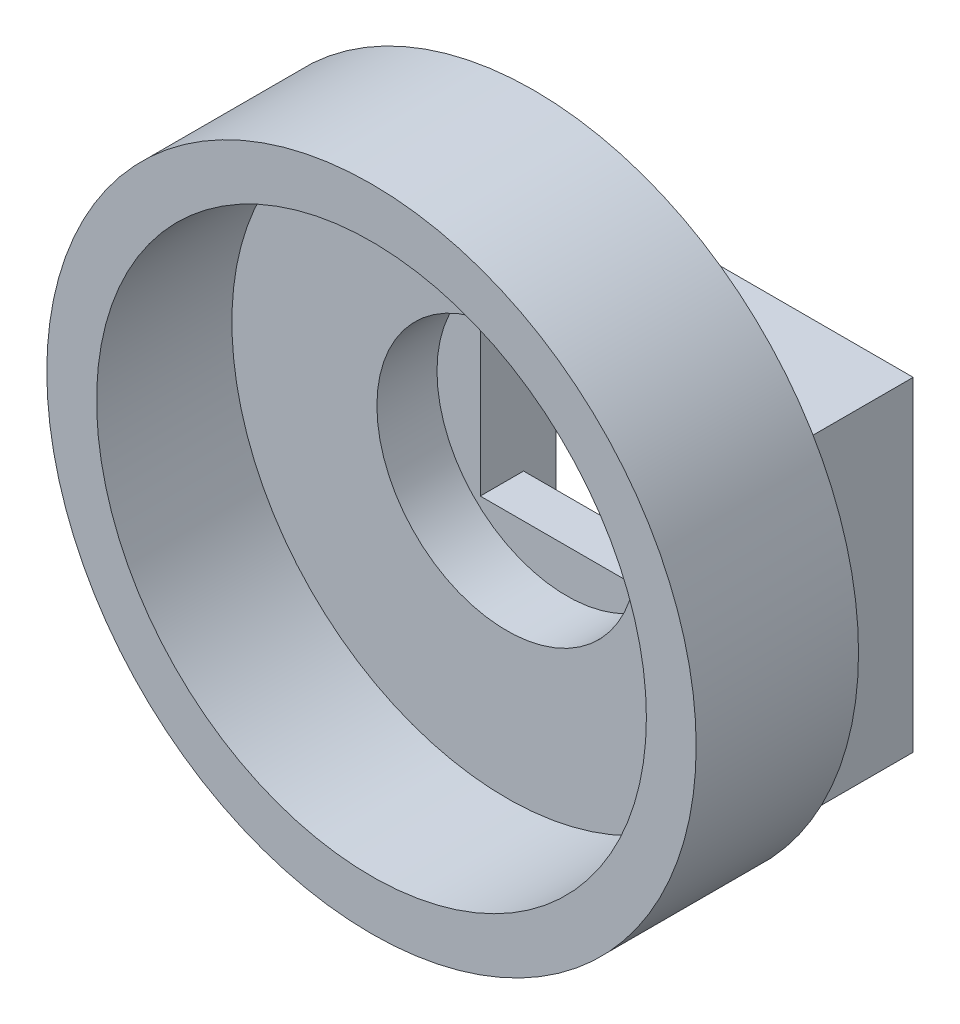
ISO-10303-21;
HEADER;
FILE_DESCRIPTION(('STEP AP214'),'2;1');
FILE_NAME('part.step','',(''),(''),'','','');
FILE_SCHEMA(('AUTOMOTIVE_DESIGN { 1 0 10303 214 1 1 1 1 }'));
ENDSEC;
DATA;
#1=APPLICATION_CONTEXT('core data for automotive mechanical design processes');
#2=APPLICATION_PROTOCOL_DEFINITION('international standard','automotive_design',2000,#1);
#3=PRODUCT_CONTEXT('',#1,'mechanical');
#4=PRODUCT('Part','Part','',(#3));
#5=PRODUCT_RELATED_PRODUCT_CATEGORY('part','',(#4));
#6=PRODUCT_DEFINITION_FORMATION('','',#4);
#7=PRODUCT_DEFINITION_CONTEXT('part definition',#1,'design');
#8=PRODUCT_DEFINITION('design','',#6,#7);
#9=PRODUCT_DEFINITION_SHAPE('','',#8);
#10=(LENGTH_UNIT() NAMED_UNIT(*) SI_UNIT(.MILLI.,.METRE.));
#11=(NAMED_UNIT(*) PLANE_ANGLE_UNIT() SI_UNIT($,.RADIAN.));
#12=(NAMED_UNIT(*) SI_UNIT($,.STERADIAN.) SOLID_ANGLE_UNIT());
#13=UNCERTAINTY_MEASURE_WITH_UNIT(LENGTH_MEASURE(1.E-05),#10,'distance_accuracy_value','');
#14=(GEOMETRIC_REPRESENTATION_CONTEXT(3) GLOBAL_UNCERTAINTY_ASSIGNED_CONTEXT((#13)) GLOBAL_UNIT_ASSIGNED_CONTEXT((#10,
#11,#12)) REPRESENTATION_CONTEXT('',''));
#15=CARTESIAN_POINT('',(0.,0.,0.));
#16=DIRECTION('',(0.,0.,1.));
#17=DIRECTION('',(1.,0.,0.));
#18=AXIS2_PLACEMENT_3D('',#15,#16,#17);
#19=CARTESIAN_POINT('',(0.,0.,0.));
#20=DIRECTION('',(0.,0.,-1.));
#21=DIRECTION('',(-1.,0.,0.));
#22=AXIS2_PLACEMENT_3D('',#19,#20,#21);
#23=PLANE('',#22);
#24=DIRECTION('',(1.,0.,0.));
#25=VECTOR('',#24,1.);
#26=CARTESIAN_POINT('',(0.,0.,0.));
#27=LINE('',#26,#25);
#28=CARTESIAN_POINT('',(16.5,0.,0.));
#29=VERTEX_POINT('',#28);
#30=CARTESIAN_POINT('',(25.,0.,0.));
#31=VERTEX_POINT('',#30);
#32=EDGE_CURVE('E225',#29,#31,#27,.T.);
#33=ORIENTED_EDGE('',*,*,#32,.F.);
#34=DIRECTION('',(0.,1.,0.));
#35=VECTOR('',#34,1.);
#36=CARTESIAN_POINT('',(16.5,0.,0.));
#37=LINE('',#36,#35);
#38=CARTESIAN_POINT('',(16.5,11.75,0.));
#39=VERTEX_POINT('',#38);
#40=EDGE_CURVE('E174',#29,#39,#37,.T.);
#41=ORIENTED_EDGE('',*,*,#40,.T.);
#42=DIRECTION('',(1.,0.,0.));
#43=VECTOR('',#42,1.);
#44=CARTESIAN_POINT('',(0.,11.75,0.));
#45=LINE('',#44,#43);
#46=CARTESIAN_POINT('',(8.5,11.75,0.));
#47=VERTEX_POINT('',#46);
#48=EDGE_CURVE('E180',#47,#39,#45,.T.);
#49=ORIENTED_EDGE('',*,*,#48,.F.);
#50=DIRECTION('',(0.,1.,0.));
#51=VECTOR('',#50,1.);
#52=CARTESIAN_POINT('',(8.5,0.,0.));
#53=LINE('',#52,#51);
#54=CARTESIAN_POINT('',(8.5,0.,0.));
#55=VERTEX_POINT('',#54);
#56=EDGE_CURVE('E177',#55,#47,#53,.T.);
#57=ORIENTED_EDGE('',*,*,#56,.F.);
#58=CARTESIAN_POINT('',(0.,0.,0.));
#59=VERTEX_POINT('',#58);
#60=EDGE_CURVE('E226',#59,#55,#27,.T.);
#61=ORIENTED_EDGE('',*,*,#60,.F.);
#62=DIRECTION('',(0.,-1.,0.));
#63=VECTOR('',#62,1.);
#64=CARTESIAN_POINT('',(0.,0.,0.));
#65=LINE('',#64,#63);
#66=CARTESIAN_POINT('',(0.,15.,0.));
#67=VERTEX_POINT('',#66);
#68=EDGE_CURVE('E211',#67,#59,#65,.T.);
#69=ORIENTED_EDGE('',*,*,#68,.F.);
#70=DIRECTION('',(-1.,0.,0.));
#71=VECTOR('',#70,1.);
#72=CARTESIAN_POINT('',(0.,15.,0.));
#73=LINE('',#72,#71);
#74=CARTESIAN_POINT('',(25.,15.,0.));
#75=VERTEX_POINT('',#74);
#76=EDGE_CURVE('E89',#75,#67,#73,.T.);
#77=ORIENTED_EDGE('',*,*,#76,.F.);
#78=DIRECTION('',(0.,1.,0.));
#79=VECTOR('',#78,1.);
#80=CARTESIAN_POINT('',(25.,0.,0.));
#81=LINE('',#80,#79);
#82=EDGE_CURVE('E84',#31,#75,#81,.T.);
#83=ORIENTED_EDGE('',*,*,#82,.F.);
#84=EDGE_LOOP('',(#33,#41,#49,#57,#61,#69,#77,#83));
#85=FACE_BOUND('',#84,.T.);
#86=CARTESIAN_POINT('',(23.,7.5,0.));
#87=DIRECTION('',(0.,0.,-1.));
#88=DIRECTION('',(-1.,0.,0.));
#89=AXIS2_PLACEMENT_3D('',#86,#87,#88);
#90=CIRCLE('',#89,0.799999999999988);
#91=CARTESIAN_POINT('',(22.2,7.5,0.));
#92=VERTEX_POINT('',#91);
#93=EDGE_CURVE('E197',#92,#92,#90,.T.);
#94=ORIENTED_EDGE('',*,*,#93,.F.);
#95=EDGE_LOOP('',(#94));
#96=FACE_BOUND('',#95,.T.);
#97=CARTESIAN_POINT('',(2.,7.5,0.));
#98=DIRECTION('',(0.,0.,-1.));
#99=DIRECTION('',(-1.,0.,0.));
#100=AXIS2_PLACEMENT_3D('',#97,#98,#99);
#101=CIRCLE('',#100,0.79999999999999);
#102=CARTESIAN_POINT('',(1.20000000000001,7.5,0.));
#103=VERTEX_POINT('',#102);
#104=EDGE_CURVE('E205',#103,#103,#101,.T.);
#105=ORIENTED_EDGE('',*,*,#104,.F.);
#106=EDGE_LOOP('',(#105));
#107=FACE_BOUND('',#106,.T.);
#108=ADVANCED_FACE('F50',(#85,#96,#107),#23,.T.);
#109=CARTESIAN_POINT('',(0.,0.,5.026));
#110=DIRECTION('',(1.,0.,0.));
#111=DIRECTION('',(0.,0.,-1.));
#112=AXIS2_PLACEMENT_3D('',#109,#110,#111);
#113=PLANE('',#112);
#114=ORIENTED_EDGE('',*,*,#68,.T.);
#115=DIRECTION('',(0.,0.,-1.));
#116=VECTOR('',#115,1.);
#117=CARTESIAN_POINT('',(0.,0.,5.026));
#118=LINE('',#117,#116);
#119=CARTESIAN_POINT('',(0.,0.,5.026));
#120=VERTEX_POINT('',#119);
#121=EDGE_CURVE('E13',#120,#59,#118,.T.);
#122=ORIENTED_EDGE('',*,*,#121,.F.);
#123=DIRECTION('',(0.,-1.,0.));
#124=VECTOR('',#123,1.);
#125=CARTESIAN_POINT('',(0.,0.,5.026));
#126=LINE('',#125,#124);
#127=CARTESIAN_POINT('',(0.,15.,5.026));
#128=VERTEX_POINT('',#127);
#129=EDGE_CURVE('E212',#128,#120,#126,.T.);
#130=ORIENTED_EDGE('',*,*,#129,.F.);
#131=DIRECTION('',(0.,0.,-1.));
#132=VECTOR('',#131,1.);
#133=CARTESIAN_POINT('',(0.,15.,5.026));
#134=LINE('',#133,#132);
#135=EDGE_CURVE('E222',#128,#67,#134,.T.);
#136=ORIENTED_EDGE('',*,*,#135,.T.);
#137=EDGE_LOOP('',(#114,#122,#130,#136));
#138=FACE_BOUND('',#137,.T.);
#139=ADVANCED_FACE('F52',(#138),#113,.F.);
#140=CARTESIAN_POINT('',(0.,0.,5.026));
#141=DIRECTION('',(0.,1.,0.));
#142=DIRECTION('',(0.,0.,1.));
#143=AXIS2_PLACEMENT_3D('',#140,#141,#142);
#144=PLANE('',#143);
#145=DIRECTION('',(1.,0.,0.));
#146=VECTOR('',#145,1.);
#147=CARTESIAN_POINT('',(0.,0.,1.5));
#148=LINE('',#147,#146);
#149=CARTESIAN_POINT('',(8.5,0.,1.5));
#150=VERTEX_POINT('',#149);
#151=CARTESIAN_POINT('',(16.5,0.,1.5));
#152=VERTEX_POINT('',#151);
#153=EDGE_CURVE('E278',#150,#152,#148,.T.);
#154=ORIENTED_EDGE('',*,*,#153,.T.);
#155=DIRECTION('',(0.,0.,-1.));
#156=VECTOR('',#155,1.);
#157=CARTESIAN_POINT('',(16.5,0.,5.026));
#158=LINE('',#157,#156);
#159=EDGE_CURVE('E178',#152,#29,#158,.T.);
#160=ORIENTED_EDGE('',*,*,#159,.T.);
#161=ORIENTED_EDGE('',*,*,#32,.T.);
#162=DIRECTION('',(0.,0.,-1.));
#163=VECTOR('',#162,1.);
#164=CARTESIAN_POINT('',(25.,0.,5.026));
#165=LINE('',#164,#163);
#166=CARTESIAN_POINT('',(25.,0.,5.026));
#167=VERTEX_POINT('',#166);
#168=EDGE_CURVE('E60',#167,#31,#165,.T.);
#169=ORIENTED_EDGE('',*,*,#168,.F.);
#170=DIRECTION('',(1.,0.,0.));
#171=VECTOR('',#170,1.);
#172=CARTESIAN_POINT('',(0.,0.,5.026));
#173=LINE('',#172,#171);
#174=EDGE_CURVE('E94',#120,#167,#173,.T.);
#175=ORIENTED_EDGE('',*,*,#174,.F.);
#176=ORIENTED_EDGE('',*,*,#121,.T.);
#177=ORIENTED_EDGE('',*,*,#60,.T.);
#178=DIRECTION('',(0.,0.,1.));
#179=VECTOR('',#178,1.);
#180=CARTESIAN_POINT('',(8.5,0.,5.026));
#181=LINE('',#180,#179);
#182=EDGE_CURVE('E280',#55,#150,#181,.T.);
#183=ORIENTED_EDGE('',*,*,#182,.T.);
#184=EDGE_LOOP('',(#154,#160,#161,#169,#175,#176,#177,#183));
#185=FACE_BOUND('',#184,.T.);
#186=ADVANCED_FACE('F264',(#185),#144,.F.);
#187=CARTESIAN_POINT('',(25.,0.,5.026));
#188=DIRECTION('',(-1.,0.,0.));
#189=DIRECTION('',(0.,0.,1.));
#190=AXIS2_PLACEMENT_3D('',#187,#188,#189);
#191=PLANE('',#190);
#192=ORIENTED_EDGE('',*,*,#82,.T.);
#193=DIRECTION('',(0.,0.,-1.));
#194=VECTOR('',#193,1.);
#195=CARTESIAN_POINT('',(25.,15.,5.026));
#196=LINE('',#195,#194);
#197=CARTESIAN_POINT('',(25.,15.,5.026));
#198=VERTEX_POINT('',#197);
#199=EDGE_CURVE('E68',#198,#75,#196,.T.);
#200=ORIENTED_EDGE('',*,*,#199,.F.);
#201=DIRECTION('',(0.,1.,0.));
#202=VECTOR('',#201,1.);
#203=CARTESIAN_POINT('',(25.,0.,5.026));
#204=LINE('',#203,#202);
#205=EDGE_CURVE('E216',#167,#198,#204,.T.);
#206=ORIENTED_EDGE('',*,*,#205,.F.);
#207=ORIENTED_EDGE('',*,*,#168,.T.);
#208=EDGE_LOOP('',(#192,#200,#206,#207));
#209=FACE_BOUND('',#208,.T.);
#210=ADVANCED_FACE('F233',(#209),#191,.F.);
#211=CARTESIAN_POINT('',(0.,15.,5.026));
#212=DIRECTION('',(0.,-1.,0.));
#213=DIRECTION('',(0.,0.,-1.));
#214=AXIS2_PLACEMENT_3D('',#211,#212,#213);
#215=PLANE('',#214);
#216=ORIENTED_EDGE('',*,*,#76,.T.);
#217=ORIENTED_EDGE('',*,*,#135,.F.);
#218=DIRECTION('',(-1.,0.,0.));
#219=VECTOR('',#218,1.);
#220=CARTESIAN_POINT('',(0.,15.,5.026));
#221=LINE('',#220,#219);
#222=EDGE_CURVE('E219',#198,#128,#221,.T.);
#223=ORIENTED_EDGE('',*,*,#222,.F.);
#224=ORIENTED_EDGE('',*,*,#199,.T.);
#225=EDGE_LOOP('',(#216,#217,#223,#224));
#226=FACE_BOUND('',#225,.T.);
#227=ADVANCED_FACE('F239',(#226),#215,.F.);
#228=CARTESIAN_POINT('',(2.,7.5,3.5));
#229=DIRECTION('',(0.,0.,-1.));
#230=DIRECTION('',(-1.,0.,0.));
#231=AXIS2_PLACEMENT_3D('',#228,#229,#230);
#232=CONICAL_SURFACE('',#231,0.799999999999999,1.02974425867665);
#233=CARTESIAN_POINT('',(2.,7.5,3.98068849522205));
#234=VERTEX_POINT('',#233);
#235=VERTEX_LOOP('',#234);
#236=FACE_BOUND('',#235,.T.);
#237=CARTESIAN_POINT('',(2.,7.5,3.5));
#238=DIRECTION('',(0.,0.,-1.));
#239=DIRECTION('',(-1.,0.,0.));
#240=AXIS2_PLACEMENT_3D('',#237,#238,#239);
#241=CIRCLE('',#240,0.799999999999999);
#242=CARTESIAN_POINT('',(1.2,7.5,3.5));
#243=VERTEX_POINT('',#242);
#244=EDGE_CURVE('E208',#243,#243,#241,.T.);
#245=ORIENTED_EDGE('',*,*,#244,.T.);
#246=EDGE_LOOP('',(#245));
#247=FACE_BOUND('',#246,.T.);
#248=ADVANCED_FACE('F267',(#236,#247),#232,.F.);
#249=CARTESIAN_POINT('',(2.,7.5,0.));
#250=DIRECTION('',(0.,0.,-1.));
#251=DIRECTION('',(-1.,0.,0.));
#252=AXIS2_PLACEMENT_3D('',#249,#250,#251);
#253=CYLINDRICAL_SURFACE('',#252,0.799999999999994);
#254=ORIENTED_EDGE('',*,*,#244,.F.);
#255=EDGE_LOOP('',(#254));
#256=FACE_BOUND('',#255,.T.);
#257=ORIENTED_EDGE('',*,*,#104,.T.);
#258=EDGE_LOOP('',(#257));
#259=FACE_BOUND('',#258,.T.);
#260=ADVANCED_FACE('F417',(#256,#259),#253,.F.);
#261=CARTESIAN_POINT('',(23.,7.5,3.5));
#262=DIRECTION('',(0.,0.,-1.));
#263=DIRECTION('',(-1.,0.,0.));
#264=AXIS2_PLACEMENT_3D('',#261,#262,#263);
#265=CONICAL_SURFACE('',#264,0.799999999999999,1.02974425867665);
#266=CARTESIAN_POINT('',(23.,7.5,3.98068849522205));
#267=VERTEX_POINT('',#266);
#268=VERTEX_LOOP('',#267);
#269=FACE_BOUND('',#268,.T.);
#270=CARTESIAN_POINT('',(23.,7.5,3.5));
#271=DIRECTION('',(0.,0.,-1.));
#272=DIRECTION('',(-1.,0.,0.));
#273=AXIS2_PLACEMENT_3D('',#270,#271,#272);
#274=CIRCLE('',#273,0.799999999999999);
#275=CARTESIAN_POINT('',(22.2,7.5,3.5));
#276=VERTEX_POINT('',#275);
#277=EDGE_CURVE('E202',#276,#276,#274,.T.);
#278=ORIENTED_EDGE('',*,*,#277,.T.);
#279=EDGE_LOOP('',(#278));
#280=FACE_BOUND('',#279,.T.);
#281=ADVANCED_FACE('F254',(#269,#280),#265,.F.);
#282=CARTESIAN_POINT('',(23.,7.5,0.));
#283=DIRECTION('',(0.,0.,-1.));
#284=DIRECTION('',(-1.,0.,0.));
#285=AXIS2_PLACEMENT_3D('',#282,#283,#284);
#286=CYLINDRICAL_SURFACE('',#285,0.799999999999993);
#287=ORIENTED_EDGE('',*,*,#277,.F.);
#288=EDGE_LOOP('',(#287));
#289=FACE_BOUND('',#288,.T.);
#290=ORIENTED_EDGE('',*,*,#93,.T.);
#291=EDGE_LOOP('',(#290));
#292=FACE_BOUND('',#291,.T.);
#293=ADVANCED_FACE('F244',(#289,#292),#286,.F.);
#294=CARTESIAN_POINT('',(12.5,7.75,5.026));
#295=DIRECTION('',(0.,0.,1.));
#296=DIRECTION('',(1.,0.,0.));
#297=AXIS2_PLACEMENT_3D('',#294,#295,#296);
#298=PLANE('',#297);
#299=CARTESIAN_POINT('',(12.5,7.75,5.026));
#300=DIRECTION('',(0.,0.,1.));
#301=DIRECTION('',(1.,0.,0.));
#302=AXIS2_PLACEMENT_3D('',#299,#300,#301);
#303=CIRCLE('',#302,15.);
#304=CARTESIAN_POINT('',(27.5,7.75,5.026));
#305=VERTEX_POINT('',#304);
#306=EDGE_CURVE('E193',#305,#305,#303,.T.);
#307=ORIENTED_EDGE('',*,*,#306,.F.);
#308=EDGE_LOOP('',(#307));
#309=FACE_BOUND('',#308,.T.);
#310=ORIENTED_EDGE('',*,*,#222,.T.);
#311=ORIENTED_EDGE('',*,*,#129,.T.);
#312=ORIENTED_EDGE('',*,*,#174,.T.);
#313=ORIENTED_EDGE('',*,*,#205,.T.);
#314=EDGE_LOOP('',(#310,#311,#312,#313));
#315=FACE_BOUND('',#314,.T.);
#316=ADVANCED_FACE('F241',(#309,#315),#298,.F.);
#317=CARTESIAN_POINT('',(12.5,7.75,12.526));
#318=DIRECTION('',(0.,0.,-1.));
#319=DIRECTION('',(-1.,0.,0.));
#320=AXIS2_PLACEMENT_3D('',#317,#318,#319);
#321=CYLINDRICAL_SURFACE('',#320,15.);
#322=CARTESIAN_POINT('',(12.5,7.75,12.526));
#323=DIRECTION('',(0.,0.,1.));
#324=DIRECTION('',(1.,0.,0.));
#325=AXIS2_PLACEMENT_3D('',#322,#323,#324);
#326=CIRCLE('',#325,15.);
#327=CARTESIAN_POINT('',(27.5,7.75,12.526));
#328=VERTEX_POINT('',#327);
#329=EDGE_CURVE('E194',#328,#328,#326,.T.);
#330=ORIENTED_EDGE('',*,*,#329,.F.);
#331=EDGE_LOOP('',(#330));
#332=FACE_BOUND('',#331,.T.);
#333=ORIENTED_EDGE('',*,*,#306,.T.);
#334=EDGE_LOOP('',(#333));
#335=FACE_BOUND('',#334,.T.);
#336=ADVANCED_FACE('F243',(#332,#335),#321,.T.);
#337=CARTESIAN_POINT('',(12.5,7.75,12.526));
#338=DIRECTION('',(0.,0.,1.));
#339=DIRECTION('',(1.,0.,0.));
#340=AXIS2_PLACEMENT_3D('',#337,#338,#339);
#341=PLANE('',#340);
#342=CARTESIAN_POINT('',(12.5,7.75,12.526));
#343=DIRECTION('',(0.,0.,1.));
#344=DIRECTION('',(1.,0.,0.));
#345=AXIS2_PLACEMENT_3D('',#342,#343,#344);
#346=CIRCLE('',#345,12.7);
#347=CARTESIAN_POINT('',(25.2,7.75,12.526));
#348=VERTEX_POINT('',#347);
#349=EDGE_CURVE('E185',#348,#348,#346,.T.);
#350=ORIENTED_EDGE('',*,*,#349,.F.);
#351=EDGE_LOOP('',(#350));
#352=FACE_BOUND('',#351,.T.);
#353=ORIENTED_EDGE('',*,*,#329,.T.);
#354=EDGE_LOOP('',(#353));
#355=FACE_BOUND('',#354,.T.);
#356=ADVANCED_FACE('F251',(#352,#355),#341,.T.);
#357=CARTESIAN_POINT('',(12.5,7.75,6.276));
#358=DIRECTION('',(0.,0.,-1.));
#359=DIRECTION('',(-1.,0.,0.));
#360=AXIS2_PLACEMENT_3D('',#357,#358,#359);
#361=PLANE('',#360);
#362=CARTESIAN_POINT('',(12.5,7.75,6.276));
#363=DIRECTION('',(0.,0.,-1.));
#364=DIRECTION('',(-1.,0.,0.));
#365=AXIS2_PLACEMENT_3D('',#362,#363,#364);
#366=CIRCLE('',#365,6.);
#367=CARTESIAN_POINT('',(6.5,7.75,6.276));
#368=VERTEX_POINT('',#367);
#369=EDGE_CURVE('E54',#368,#368,#366,.T.);
#370=ORIENTED_EDGE('',*,*,#369,.T.);
#371=EDGE_LOOP('',(#370));
#372=FACE_BOUND('',#371,.T.);
#373=CARTESIAN_POINT('',(12.5,7.75,6.276));
#374=DIRECTION('',(0.,0.,1.));
#375=DIRECTION('',(1.,0.,0.));
#376=AXIS2_PLACEMENT_3D('',#373,#374,#375);
#377=CIRCLE('',#376,12.7);
#378=CARTESIAN_POINT('',(25.2,7.75,6.276));
#379=VERTEX_POINT('',#378);
#380=EDGE_CURVE('E190',#379,#379,#377,.T.);
#381=ORIENTED_EDGE('',*,*,#380,.T.);
#382=EDGE_LOOP('',(#381));
#383=FACE_BOUND('',#382,.T.);
#384=ADVANCED_FACE('F306',(#372,#383),#361,.F.);
#385=CARTESIAN_POINT('',(12.5,7.75,12.526));
#386=DIRECTION('',(0.,0.,1.));
#387=DIRECTION('',(1.,0.,0.));
#388=AXIS2_PLACEMENT_3D('',#385,#386,#387);
#389=CYLINDRICAL_SURFACE('',#388,12.7);
#390=ORIENTED_EDGE('',*,*,#380,.F.);
#391=EDGE_LOOP('',(#390));
#392=FACE_BOUND('',#391,.T.);
#393=ORIENTED_EDGE('',*,*,#349,.T.);
#394=EDGE_LOOP('',(#393));
#395=FACE_BOUND('',#394,.T.);
#396=ADVANCED_FACE('F327',(#392,#395),#389,.F.);
#397=CARTESIAN_POINT('',(16.5,0.,3.5));
#398=DIRECTION('',(-1.,0.,0.));
#399=DIRECTION('',(0.,0.,1.));
#400=AXIS2_PLACEMENT_3D('',#397,#398,#399);
#401=PLANE('',#400);
#402=ORIENTED_EDGE('',*,*,#40,.F.);
#403=ORIENTED_EDGE('',*,*,#159,.F.);
#404=DIRECTION('',(0.,1.,0.));
#405=VECTOR('',#404,1.);
#406=CARTESIAN_POINT('',(16.5,-9.75,1.5));
#407=LINE('',#406,#405);
#408=CARTESIAN_POINT('',(16.5,3.75,1.5));
#409=VERTEX_POINT('',#408);
#410=EDGE_CURVE('E285',#152,#409,#407,.T.);
#411=ORIENTED_EDGE('',*,*,#410,.T.);
#412=DIRECTION('',(0.,0.,-1.));
#413=VECTOR('',#412,1.);
#414=CARTESIAN_POINT('',(16.5,3.75,3.5));
#415=LINE('',#414,#413);
#416=CARTESIAN_POINT('',(16.5,3.75,3.5));
#417=VERTEX_POINT('',#416);
#418=EDGE_CURVE('E164',#417,#409,#415,.T.);
#419=ORIENTED_EDGE('',*,*,#418,.F.);
#420=DIRECTION('',(0.,1.,0.));
#421=VECTOR('',#420,1.);
#422=CARTESIAN_POINT('',(16.5,0.,3.5));
#423=LINE('',#422,#421);
#424=CARTESIAN_POINT('',(16.5,11.75,3.5));
#425=VERTEX_POINT('',#424);
#426=EDGE_CURVE('E150',#417,#425,#423,.T.);
#427=ORIENTED_EDGE('',*,*,#426,.T.);
#428=DIRECTION('',(0.,0.,-1.));
#429=VECTOR('',#428,1.);
#430=CARTESIAN_POINT('',(16.5,11.75,3.5));
#431=LINE('',#430,#429);
#432=EDGE_CURVE('E183',#425,#39,#431,.T.);
#433=ORIENTED_EDGE('',*,*,#432,.T.);
#434=EDGE_LOOP('',(#402,#403,#411,#419,#427,#433));
#435=FACE_BOUND('',#434,.T.);
#436=ADVANCED_FACE('F290',(#435),#401,.T.);
#437=CARTESIAN_POINT('',(0.,11.75,3.5));
#438=DIRECTION('',(0.,1.,0.));
#439=DIRECTION('',(-1.,0.,0.));
#440=AXIS2_PLACEMENT_3D('',#437,#438,#439);
#441=PLANE('',#440);
#442=ORIENTED_EDGE('',*,*,#48,.T.);
#443=ORIENTED_EDGE('',*,*,#432,.F.);
#444=DIRECTION('',(1.,0.,0.));
#445=VECTOR('',#444,1.);
#446=CARTESIAN_POINT('',(0.,11.75,3.5));
#447=LINE('',#446,#445);
#448=CARTESIAN_POINT('',(8.5,11.75,3.5));
#449=VERTEX_POINT('',#448);
#450=EDGE_CURVE('E169',#449,#425,#447,.T.);
#451=ORIENTED_EDGE('',*,*,#450,.F.);
#452=DIRECTION('',(0.,0.,-1.));
#453=VECTOR('',#452,1.);
#454=CARTESIAN_POINT('',(8.5,11.75,3.5));
#455=LINE('',#454,#453);
#456=EDGE_CURVE('E163',#449,#47,#455,.T.);
#457=ORIENTED_EDGE('',*,*,#456,.T.);
#458=EDGE_LOOP('',(#442,#443,#451,#457));
#459=FACE_BOUND('',#458,.T.);
#460=ADVANCED_FACE('F292',(#459),#441,.F.);
#461=CARTESIAN_POINT('',(8.5,0.,3.5));
#462=DIRECTION('',(-1.,0.,0.));
#463=DIRECTION('',(0.,0.,1.));
#464=AXIS2_PLACEMENT_3D('',#461,#462,#463);
#465=PLANE('',#464);
#466=ORIENTED_EDGE('',*,*,#56,.T.);
#467=ORIENTED_EDGE('',*,*,#456,.F.);
#468=DIRECTION('',(0.,1.,0.));
#469=VECTOR('',#468,1.);
#470=CARTESIAN_POINT('',(8.5,0.,3.5));
#471=LINE('',#470,#469);
#472=CARTESIAN_POINT('',(8.5,3.75,3.5));
#473=VERTEX_POINT('',#472);
#474=EDGE_CURVE('E147',#473,#449,#471,.T.);
#475=ORIENTED_EDGE('',*,*,#474,.F.);
#476=DIRECTION('',(0.,0.,-1.));
#477=VECTOR('',#476,1.);
#478=CARTESIAN_POINT('',(8.5,3.75,3.5));
#479=LINE('',#478,#477);
#480=CARTESIAN_POINT('',(8.5,3.75,1.5));
#481=VERTEX_POINT('',#480);
#482=EDGE_CURVE('E157',#473,#481,#479,.T.);
#483=ORIENTED_EDGE('',*,*,#482,.T.);
#484=DIRECTION('',(0.,1.,0.));
#485=VECTOR('',#484,1.);
#486=CARTESIAN_POINT('',(8.5,-9.75,1.5));
#487=LINE('',#486,#485);
#488=EDGE_CURVE('E295',#150,#481,#487,.T.);
#489=ORIENTED_EDGE('',*,*,#488,.F.);
#490=ORIENTED_EDGE('',*,*,#182,.F.);
#491=EDGE_LOOP('',(#466,#467,#475,#483,#489,#490));
#492=FACE_BOUND('',#491,.T.);
#493=ADVANCED_FACE('F167',(#492),#465,.F.);
#494=CARTESIAN_POINT('',(0.,3.75,3.5));
#495=DIRECTION('',(0.,1.,0.));
#496=DIRECTION('',(-1.,0.,0.));
#497=AXIS2_PLACEMENT_3D('',#494,#495,#496);
#498=PLANE('',#497);
#499=DIRECTION('',(1.,0.,0.));
#500=VECTOR('',#499,1.);
#501=CARTESIAN_POINT('',(16.5,3.75,1.5));
#502=LINE('',#501,#500);
#503=EDGE_CURVE('E160',#481,#409,#502,.T.);
#504=ORIENTED_EDGE('',*,*,#503,.F.);
#505=ORIENTED_EDGE('',*,*,#482,.F.);
#506=DIRECTION('',(1.,0.,0.));
#507=VECTOR('',#506,1.);
#508=CARTESIAN_POINT('',(0.,3.75,3.5));
#509=LINE('',#508,#507);
#510=EDGE_CURVE('E142',#473,#417,#509,.T.);
#511=ORIENTED_EDGE('',*,*,#510,.T.);
#512=ORIENTED_EDGE('',*,*,#418,.T.);
#513=EDGE_LOOP('',(#504,#505,#511,#512));
#514=FACE_BOUND('',#513,.T.);
#515=ADVANCED_FACE('F158',(#514),#498,.T.);
#516=CARTESIAN_POINT('',(16.5,-9.75,1.5));
#517=DIRECTION('',(0.,0.,1.));
#518=DIRECTION('',(1.,0.,0.));
#519=AXIS2_PLACEMENT_3D('',#516,#517,#518);
#520=PLANE('',#519);
#521=ORIENTED_EDGE('',*,*,#488,.T.);
#522=ORIENTED_EDGE('',*,*,#503,.T.);
#523=ORIENTED_EDGE('',*,*,#410,.F.);
#524=ORIENTED_EDGE('',*,*,#153,.F.);
#525=EDGE_LOOP('',(#521,#522,#523,#524));
#526=FACE_BOUND('',#525,.T.);
#527=ADVANCED_FACE('F294',(#526),#520,.F.);
#528=CARTESIAN_POINT('',(12.5,7.75,17.));
#529=DIRECTION('',(0.,0.,-1.));
#530=DIRECTION('',(-1.,0.,0.));
#531=AXIS2_PLACEMENT_3D('',#528,#529,#530);
#532=CYLINDRICAL_SURFACE('',#531,6.);
#533=CARTESIAN_POINT('',(12.5,7.75,3.5));
#534=DIRECTION('',(0.,0.,-1.));
#535=DIRECTION('',(-1.,0.,0.));
#536=AXIS2_PLACEMENT_3D('',#533,#534,#535);
#537=CIRCLE('',#536,6.);
#538=CARTESIAN_POINT('',(6.5,7.75,3.5));
#539=VERTEX_POINT('',#538);
#540=EDGE_CURVE('E299',#539,#539,#537,.T.);
#541=ORIENTED_EDGE('',*,*,#540,.T.);
#542=EDGE_LOOP('',(#541));
#543=FACE_BOUND('',#542,.T.);
#544=ORIENTED_EDGE('',*,*,#369,.F.);
#545=EDGE_LOOP('',(#544));
#546=FACE_BOUND('',#545,.T.);
#547=ADVANCED_FACE('F309',(#543,#546),#532,.F.);
#548=CARTESIAN_POINT('',(12.5,7.75,3.5));
#549=DIRECTION('',(0.,0.,-1.));
#550=DIRECTION('',(-1.,0.,0.));
#551=AXIS2_PLACEMENT_3D('',#548,#549,#550);
#552=PLANE('',#551);
#553=ORIENTED_EDGE('',*,*,#426,.F.);
#554=ORIENTED_EDGE('',*,*,#510,.F.);
#555=ORIENTED_EDGE('',*,*,#474,.T.);
#556=ORIENTED_EDGE('',*,*,#450,.T.);
#557=EDGE_LOOP('',(#553,#554,#555,#556));
#558=FACE_BOUND('',#557,.T.);
#559=ORIENTED_EDGE('',*,*,#540,.F.);
#560=EDGE_LOOP('',(#559));
#561=FACE_BOUND('',#560,.T.);
#562=ADVANCED_FACE('F144',(#558,#561),#552,.F.);
#563=CLOSED_SHELL('',(#108,#139,#186,#210,#227,#248,#260,#281,#293,#316,#336,#356,#384,#396,
#436,#460,#493,#515,#527,#547,#562));
#564=MANIFOLD_SOLID_BREP('B2',#563);
#565=ADVANCED_BREP_SHAPE_REPRESENTATION('',(#18,#564),#14);
#566=SHAPE_DEFINITION_REPRESENTATION(#9,#565);
ENDSEC;
END-ISO-10303-21;
